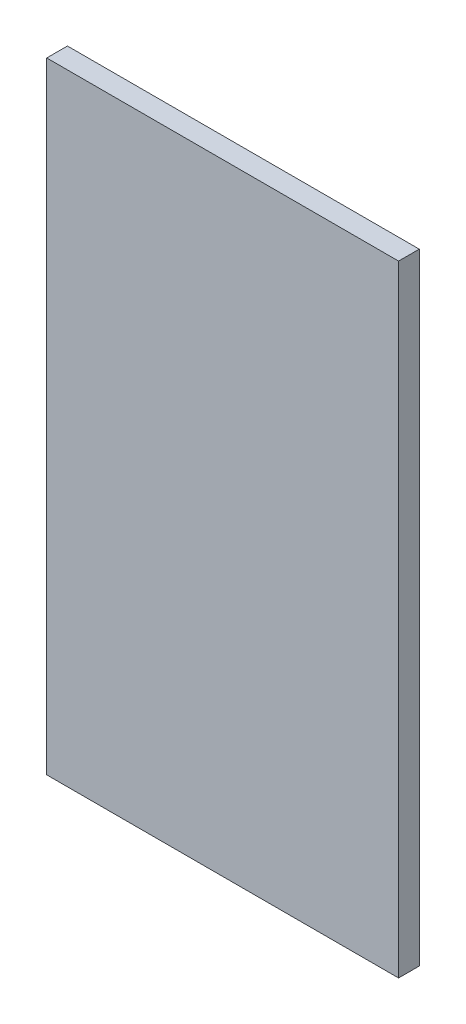
ISO-10303-21;
HEADER;
FILE_DESCRIPTION(('STEP AP214'),'2;1');
FILE_NAME('part.step','',(''),(''),'','','');
FILE_SCHEMA(('AUTOMOTIVE_DESIGN { 1 0 10303 214 1 1 1 1 }'));
ENDSEC;
DATA;
#1=APPLICATION_CONTEXT('core data for automotive mechanical design processes');
#2=APPLICATION_PROTOCOL_DEFINITION('international standard','automotive_design',2000,#1);
#3=PRODUCT_CONTEXT('',#1,'mechanical');
#4=PRODUCT('Part','Part','',(#3));
#5=PRODUCT_RELATED_PRODUCT_CATEGORY('part','',(#4));
#6=PRODUCT_DEFINITION_FORMATION('','',#4);
#7=PRODUCT_DEFINITION_CONTEXT('part definition',#1,'design');
#8=PRODUCT_DEFINITION('design','',#6,#7);
#9=PRODUCT_DEFINITION_SHAPE('','',#8);
#10=(LENGTH_UNIT() NAMED_UNIT(*) SI_UNIT(.MILLI.,.METRE.));
#11=(NAMED_UNIT(*) PLANE_ANGLE_UNIT() SI_UNIT($,.RADIAN.));
#12=(NAMED_UNIT(*) SI_UNIT($,.STERADIAN.) SOLID_ANGLE_UNIT());
#13=UNCERTAINTY_MEASURE_WITH_UNIT(LENGTH_MEASURE(1.E-05),#10,'distance_accuracy_value','');
#14=(GEOMETRIC_REPRESENTATION_CONTEXT(3) GLOBAL_UNCERTAINTY_ASSIGNED_CONTEXT((#13)) GLOBAL_UNIT_ASSIGNED_CONTEXT((#10,
#11,#12)) REPRESENTATION_CONTEXT('',''));
#15=CARTESIAN_POINT('',(0.,0.,0.));
#16=DIRECTION('',(0.,0.,1.));
#17=DIRECTION('',(1.,0.,0.));
#18=AXIS2_PLACEMENT_3D('',#15,#16,#17);
#19=CARTESIAN_POINT('',(113.417429749213,23.7371927745717,10.));
#20=DIRECTION('',(0.,-1.,0.));
#21=DIRECTION('',(1.,0.,0.));
#22=AXIS2_PLACEMENT_3D('',#19,#20,#21);
#23=PLANE('',#22);
#24=DIRECTION('',(-1.,0.,0.));
#25=VECTOR('',#24,1.);
#26=CARTESIAN_POINT('',(113.417429749213,23.7371927745717,0.));
#27=LINE('',#26,#25);
#28=CARTESIAN_POINT('',(113.417429749213,23.7371927745717,0.));
#29=VERTEX_POINT('',#28);
#30=CARTESIAN_POINT('',(-56.5825702507872,23.7371927745717,0.));
#31=VERTEX_POINT('',#30);
#32=EDGE_CURVE('E98',#29,#31,#27,.T.);
#33=ORIENTED_EDGE('',*,*,#32,.T.);
#34=DIRECTION('',(0.,0.,-1.));
#35=VECTOR('',#34,1.);
#36=CARTESIAN_POINT('',(-56.5825702507872,23.7371927745717,10.));
#37=LINE('',#36,#35);
#38=CARTESIAN_POINT('',(-56.5825702507872,23.7371927745717,10.));
#39=VERTEX_POINT('',#38);
#40=EDGE_CURVE('E11',#39,#31,#37,.T.);
#41=ORIENTED_EDGE('',*,*,#40,.F.);
#42=DIRECTION('',(-1.,0.,0.));
#43=VECTOR('',#42,1.);
#44=CARTESIAN_POINT('',(113.417429749213,23.7371927745717,10.));
#45=LINE('',#44,#43);
#46=CARTESIAN_POINT('',(113.417429749213,23.7371927745717,10.));
#47=VERTEX_POINT('',#46);
#48=EDGE_CURVE('E86',#47,#39,#45,.T.);
#49=ORIENTED_EDGE('',*,*,#48,.F.);
#50=DIRECTION('',(0.,0.,-1.));
#51=VECTOR('',#50,1.);
#52=CARTESIAN_POINT('',(113.417429749213,23.7371927745717,10.));
#53=LINE('',#52,#51);
#54=EDGE_CURVE('E94',#47,#29,#53,.T.);
#55=ORIENTED_EDGE('',*,*,#54,.T.);
#56=EDGE_LOOP('',(#33,#41,#49,#55));
#57=FACE_BOUND('',#56,.T.);
#58=ADVANCED_FACE('F35',(#57),#23,.F.);
#59=CARTESIAN_POINT('',(-56.5825702507872,23.7371927745717,10.));
#60=DIRECTION('',(1.,0.,0.));
#61=DIRECTION('',(0.,0.,-1.));
#62=AXIS2_PLACEMENT_3D('',#59,#60,#61);
#63=PLANE('',#62);
#64=DIRECTION('',(0.,-1.,0.));
#65=VECTOR('',#64,1.);
#66=CARTESIAN_POINT('',(-56.5825702507872,23.7371927745717,0.));
#67=LINE('',#66,#65);
#68=CARTESIAN_POINT('',(-56.5825702507872,-276.262807225428,0.));
#69=VERTEX_POINT('',#68);
#70=EDGE_CURVE('E90',#31,#69,#67,.T.);
#71=ORIENTED_EDGE('',*,*,#70,.T.);
#72=DIRECTION('',(0.,0.,-1.));
#73=VECTOR('',#72,1.);
#74=CARTESIAN_POINT('',(-56.5825702507872,-276.262807225428,10.));
#75=LINE('',#74,#73);
#76=CARTESIAN_POINT('',(-56.5825702507872,-276.262807225428,10.));
#77=VERTEX_POINT('',#76);
#78=EDGE_CURVE('E43',#77,#69,#75,.T.);
#79=ORIENTED_EDGE('',*,*,#78,.F.);
#80=DIRECTION('',(0.,-1.,0.));
#81=VECTOR('',#80,1.);
#82=CARTESIAN_POINT('',(-56.5825702507872,23.7371927745717,10.));
#83=LINE('',#82,#81);
#84=EDGE_CURVE('E81',#39,#77,#83,.T.);
#85=ORIENTED_EDGE('',*,*,#84,.F.);
#86=ORIENTED_EDGE('',*,*,#40,.T.);
#87=EDGE_LOOP('',(#71,#79,#85,#86));
#88=FACE_BOUND('',#87,.T.);
#89=ADVANCED_FACE('F89',(#88),#63,.F.);
#90=CARTESIAN_POINT('',(-56.5825702507872,-276.262807225428,10.));
#91=DIRECTION('',(0.,1.,0.));
#92=DIRECTION('',(0.,0.,1.));
#93=AXIS2_PLACEMENT_3D('',#90,#91,#92);
#94=PLANE('',#93);
#95=DIRECTION('',(1.,0.,0.));
#96=VECTOR('',#95,1.);
#97=CARTESIAN_POINT('',(-56.5825702507872,-276.262807225428,0.));
#98=LINE('',#97,#96);
#99=CARTESIAN_POINT('',(113.417429749213,-276.262807225428,0.));
#100=VERTEX_POINT('',#99);
#101=EDGE_CURVE('E68',#69,#100,#98,.T.);
#102=ORIENTED_EDGE('',*,*,#101,.T.);
#103=DIRECTION('',(0.,0.,-1.));
#104=VECTOR('',#103,1.);
#105=CARTESIAN_POINT('',(113.417429749213,-276.262807225428,10.));
#106=LINE('',#105,#104);
#107=CARTESIAN_POINT('',(113.417429749213,-276.262807225428,10.));
#108=VERTEX_POINT('',#107);
#109=EDGE_CURVE('E91',#108,#100,#106,.T.);
#110=ORIENTED_EDGE('',*,*,#109,.F.);
#111=DIRECTION('',(1.,0.,0.));
#112=VECTOR('',#111,1.);
#113=CARTESIAN_POINT('',(-56.5825702507872,-276.262807225428,10.));
#114=LINE('',#113,#112);
#115=EDGE_CURVE('E84',#77,#108,#114,.T.);
#116=ORIENTED_EDGE('',*,*,#115,.F.);
#117=ORIENTED_EDGE('',*,*,#78,.T.);
#118=EDGE_LOOP('',(#102,#110,#116,#117));
#119=FACE_BOUND('',#118,.T.);
#120=ADVANCED_FACE('F92',(#119),#94,.F.);
#121=CARTESIAN_POINT('',(113.417429749213,-276.262807225428,10.));
#122=DIRECTION('',(-1.,0.,0.));
#123=DIRECTION('',(0.,0.,1.));
#124=AXIS2_PLACEMENT_3D('',#121,#122,#123);
#125=PLANE('',#124);
#126=DIRECTION('',(0.,1.,0.));
#127=VECTOR('',#126,1.);
#128=CARTESIAN_POINT('',(113.417429749213,-276.262807225428,0.));
#129=LINE('',#128,#127);
#130=EDGE_CURVE('E74',#100,#29,#129,.T.);
#131=ORIENTED_EDGE('',*,*,#130,.T.);
#132=ORIENTED_EDGE('',*,*,#54,.F.);
#133=DIRECTION('',(0.,1.,0.));
#134=VECTOR('',#133,1.);
#135=CARTESIAN_POINT('',(113.417429749213,-276.262807225428,10.));
#136=LINE('',#135,#134);
#137=EDGE_CURVE('E51',#108,#47,#136,.T.);
#138=ORIENTED_EDGE('',*,*,#137,.F.);
#139=ORIENTED_EDGE('',*,*,#109,.T.);
#140=EDGE_LOOP('',(#131,#132,#138,#139));
#141=FACE_BOUND('',#140,.T.);
#142=ADVANCED_FACE('F105',(#141),#125,.F.);
#143=CARTESIAN_POINT('',(0.,0.,10.));
#144=DIRECTION('',(0.,0.,1.));
#145=DIRECTION('',(1.,0.,0.));
#146=AXIS2_PLACEMENT_3D('',#143,#144,#145);
#147=PLANE('',#146);
#148=ORIENTED_EDGE('',*,*,#48,.T.);
#149=ORIENTED_EDGE('',*,*,#84,.T.);
#150=ORIENTED_EDGE('',*,*,#115,.T.);
#151=ORIENTED_EDGE('',*,*,#137,.T.);
#152=EDGE_LOOP('',(#148,#149,#150,#151));
#153=FACE_BOUND('',#152,.T.);
#154=ADVANCED_FACE('F82',(#153),#147,.T.);
#155=CARTESIAN_POINT('',(0.,0.,0.));
#156=DIRECTION('',(0.,0.,1.));
#157=DIRECTION('',(1.,0.,0.));
#158=AXIS2_PLACEMENT_3D('',#155,#156,#157);
#159=PLANE('',#158);
#160=ORIENTED_EDGE('',*,*,#32,.F.);
#161=ORIENTED_EDGE('',*,*,#130,.F.);
#162=ORIENTED_EDGE('',*,*,#101,.F.);
#163=ORIENTED_EDGE('',*,*,#70,.F.);
#164=EDGE_LOOP('',(#160,#161,#162,#163));
#165=FACE_BOUND('',#164,.T.);
#166=ADVANCED_FACE('F108',(#165),#159,.F.);
#167=CLOSED_SHELL('',(#58,#89,#120,#142,#154,#166));
#168=MANIFOLD_SOLID_BREP('B2',#167);
#169=ADVANCED_BREP_SHAPE_REPRESENTATION('',(#18,#168),#14);
#170=SHAPE_DEFINITION_REPRESENTATION(#9,#169);
ENDSEC;
END-ISO-10303-21;
